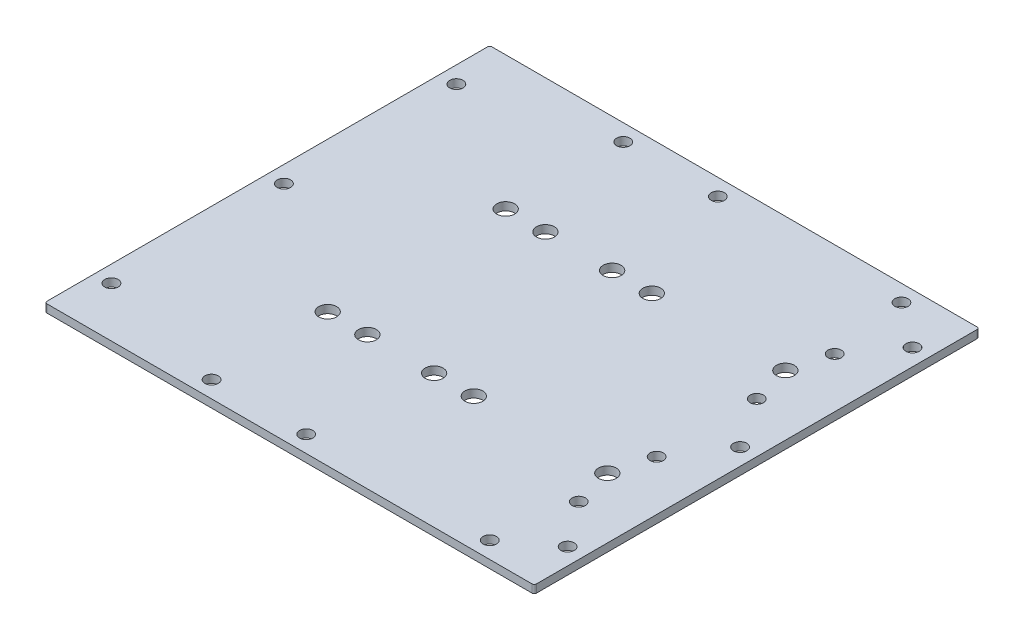
ISO-10303-21;
HEADER;
FILE_DESCRIPTION(('STEP AP214'),'2;1');
FILE_NAME('part.step','',(''),(''),'','','');
FILE_SCHEMA(('AUTOMOTIVE_DESIGN { 1 0 10303 214 1 1 1 1 }'));
ENDSEC;
DATA;
#1=APPLICATION_CONTEXT('core data for automotive mechanical design processes');
#2=APPLICATION_PROTOCOL_DEFINITION('international standard','automotive_design',2000,#1);
#3=PRODUCT_CONTEXT('',#1,'mechanical');
#4=PRODUCT('Part','Part','',(#3));
#5=PRODUCT_RELATED_PRODUCT_CATEGORY('part','',(#4));
#6=PRODUCT_DEFINITION_FORMATION('','',#4);
#7=PRODUCT_DEFINITION_CONTEXT('part definition',#1,'design');
#8=PRODUCT_DEFINITION('design','',#6,#7);
#9=PRODUCT_DEFINITION_SHAPE('','',#8);
#10=(LENGTH_UNIT() NAMED_UNIT(*) SI_UNIT(.MILLI.,.METRE.));
#11=(NAMED_UNIT(*) PLANE_ANGLE_UNIT() SI_UNIT($,.RADIAN.));
#12=(NAMED_UNIT(*) SI_UNIT($,.STERADIAN.) SOLID_ANGLE_UNIT());
#13=UNCERTAINTY_MEASURE_WITH_UNIT(LENGTH_MEASURE(1.E-05),#10,'distance_accuracy_value','');
#14=(GEOMETRIC_REPRESENTATION_CONTEXT(3) GLOBAL_UNCERTAINTY_ASSIGNED_CONTEXT((#13)) GLOBAL_UNIT_ASSIGNED_CONTEXT((#10,
#11,#12)) REPRESENTATION_CONTEXT('',''));
#15=CARTESIAN_POINT('',(0.,0.,0.));
#16=DIRECTION('',(0.,0.,1.));
#17=DIRECTION('',(1.,0.,0.));
#18=AXIS2_PLACEMENT_3D('',#15,#16,#17);
#19=CARTESIAN_POINT('',(0.,2.286,0.));
#20=DIRECTION('',(0.,-1.,0.));
#21=DIRECTION('',(0.,0.,-1.));
#22=AXIS2_PLACEMENT_3D('',#19,#20,#21);
#23=PLANE('',#22);
#24=CARTESIAN_POINT('',(55.5625,2.286,36.5125));
#25=DIRECTION('',(0.,-1.,0.));
#26=DIRECTION('',(0.,0.,-1.));
#27=AXIS2_PLACEMENT_3D('',#24,#25,#26);
#28=CIRCLE('',#27,1.89865000000001);
#29=CARTESIAN_POINT('',(55.5625,2.286,34.61385));
#30=VERTEX_POINT('',#29);
#31=EDGE_CURVE('E699',#30,#30,#28,.T.);
#32=ORIENTED_EDGE('',*,*,#31,.T.);
#33=EDGE_LOOP('',(#32));
#34=FACE_BOUND('',#33,.T.);
#35=CARTESIAN_POINT('',(55.5625,2.286,14.2875));
#36=DIRECTION('',(0.,-1.,0.));
#37=DIRECTION('',(0.,0.,-1.));
#38=AXIS2_PLACEMENT_3D('',#35,#36,#37);
#39=CIRCLE('',#38,1.89865000000001);
#40=CARTESIAN_POINT('',(55.5625,2.286,12.38885));
#41=VERTEX_POINT('',#40);
#42=EDGE_CURVE('E728',#41,#41,#39,.T.);
#43=ORIENTED_EDGE('',*,*,#42,.T.);
#44=EDGE_LOOP('',(#43));
#45=FACE_BOUND('',#44,.T.);
#46=CARTESIAN_POINT('',(55.5625,2.286,-14.2875));
#47=DIRECTION('',(0.,-1.,0.));
#48=DIRECTION('',(0.,0.,-1.));
#49=AXIS2_PLACEMENT_3D('',#46,#47,#48);
#50=CIRCLE('',#49,1.89865000000001);
#51=CARTESIAN_POINT('',(55.5625,2.286,-16.18615));
#52=VERTEX_POINT('',#51);
#53=EDGE_CURVE('E722',#52,#52,#50,.T.);
#54=ORIENTED_EDGE('',*,*,#53,.T.);
#55=EDGE_LOOP('',(#54));
#56=FACE_BOUND('',#55,.T.);
#57=CARTESIAN_POINT('',(55.5625,2.286,-36.5125));
#58=DIRECTION('',(0.,-1.,0.));
#59=DIRECTION('',(0.,0.,-1.));
#60=AXIS2_PLACEMENT_3D('',#57,#58,#59);
#61=CIRCLE('',#60,1.89865000000001);
#62=CARTESIAN_POINT('',(55.5625,2.286,-38.41115));
#63=VERTEX_POINT('',#62);
#64=EDGE_CURVE('E716',#63,#63,#61,.T.);
#65=ORIENTED_EDGE('',*,*,#64,.T.);
#66=EDGE_LOOP('',(#65));
#67=FACE_BOUND('',#66,.T.);
#68=CARTESIAN_POINT('',(-26.9875,2.286,58.7375));
#69=DIRECTION('',(0.,-1.,0.));
#70=DIRECTION('',(0.,0.,-1.));
#71=AXIS2_PLACEMENT_3D('',#68,#69,#70);
#72=CIRCLE('',#71,1.89865);
#73=CARTESIAN_POINT('',(-26.9875,2.286,56.83885));
#74=VERTEX_POINT('',#73);
#75=EDGE_CURVE('E687',#74,#74,#72,.T.);
#76=ORIENTED_EDGE('',*,*,#75,.T.);
#77=EDGE_LOOP('',(#76));
#78=FACE_BOUND('',#77,.T.);
#79=CARTESIAN_POINT('',(65.0875,2.286,49.2125));
#80=DIRECTION('',(0.,-1.,0.));
#81=DIRECTION('',(0.,0.,-1.));
#82=AXIS2_PLACEMENT_3D('',#79,#80,#81);
#83=CIRCLE('',#82,1.89865000000001);
#84=CARTESIAN_POINT('',(65.0875,2.286,47.31385));
#85=VERTEX_POINT('',#84);
#86=EDGE_CURVE('E677',#85,#85,#83,.T.);
#87=ORIENTED_EDGE('',*,*,#86,.T.);
#88=EDGE_LOOP('',(#87));
#89=FACE_BOUND('',#88,.T.);
#90=CARTESIAN_POINT('',(-65.0875,2.286,49.2125));
#91=DIRECTION('',(0.,-1.,0.));
#92=DIRECTION('',(0.,0.,-1.));
#93=AXIS2_PLACEMENT_3D('',#90,#91,#92);
#94=CIRCLE('',#93,1.89865000000001);
#95=CARTESIAN_POINT('',(-65.0875,2.286,47.31385));
#96=VERTEX_POINT('',#95);
#97=EDGE_CURVE('E676',#96,#96,#94,.T.);
#98=ORIENTED_EDGE('',*,*,#97,.T.);
#99=EDGE_LOOP('',(#98));
#100=FACE_BOUND('',#99,.T.);
#101=CARTESIAN_POINT('',(52.3875,2.286,58.7375));
#102=DIRECTION('',(0.,-1.,0.));
#103=DIRECTION('',(0.,0.,-1.));
#104=AXIS2_PLACEMENT_3D('',#101,#102,#103);
#105=CIRCLE('',#104,1.89865);
#106=CARTESIAN_POINT('',(52.3875,2.286,56.83885));
#107=VERTEX_POINT('',#106);
#108=EDGE_CURVE('E645',#107,#107,#105,.T.);
#109=ORIENTED_EDGE('',*,*,#108,.T.);
#110=EDGE_LOOP('',(#109));
#111=FACE_BOUND('',#110,.T.);
#112=CARTESIAN_POINT('',(-65.0875,2.286,0.));
#113=DIRECTION('',(0.,-1.,0.));
#114=DIRECTION('',(0.,0.,-1.));
#115=AXIS2_PLACEMENT_3D('',#112,#113,#114);
#116=CIRCLE('',#115,1.89865000000001);
#117=CARTESIAN_POINT('',(-65.0875,2.286,-1.89865000000001));
#118=VERTEX_POINT('',#117);
#119=EDGE_CURVE('E669',#118,#118,#116,.T.);
#120=ORIENTED_EDGE('',*,*,#119,.T.);
#121=EDGE_LOOP('',(#120));
#122=FACE_BOUND('',#121,.T.);
#123=CARTESIAN_POINT('',(65.0875,2.286,0.));
#124=DIRECTION('',(0.,-1.,0.));
#125=DIRECTION('',(0.,0.,-1.));
#126=AXIS2_PLACEMENT_3D('',#123,#124,#125);
#127=CIRCLE('',#126,1.89865000000001);
#128=CARTESIAN_POINT('',(65.0875,2.286,-1.89865000000001));
#129=VERTEX_POINT('',#128);
#130=EDGE_CURVE('E663',#129,#129,#127,.T.);
#131=ORIENTED_EDGE('',*,*,#130,.T.);
#132=EDGE_LOOP('',(#131));
#133=FACE_BOUND('',#132,.T.);
#134=CARTESIAN_POINT('',(-26.9875,2.286,-58.7375));
#135=DIRECTION('',(0.,-1.,0.));
#136=DIRECTION('',(0.,0.,1.));
#137=AXIS2_PLACEMENT_3D('',#134,#135,#136);
#138=CIRCLE('',#137,1.89865);
#139=CARTESIAN_POINT('',(-26.9875,2.286,-56.83885));
#140=VERTEX_POINT('',#139);
#141=EDGE_CURVE('E657',#140,#140,#138,.T.);
#142=ORIENTED_EDGE('',*,*,#141,.T.);
#143=EDGE_LOOP('',(#142));
#144=FACE_BOUND('',#143,.T.);
#145=CARTESIAN_POINT('',(52.3875,2.286,-58.7375));
#146=DIRECTION('',(0.,-1.,0.));
#147=DIRECTION('',(0.,0.,1.));
#148=AXIS2_PLACEMENT_3D('',#145,#146,#147);
#149=CIRCLE('',#148,1.89865);
#150=CARTESIAN_POINT('',(52.3875,2.286,-56.83885));
#151=VERTEX_POINT('',#150);
#152=EDGE_CURVE('E650',#151,#151,#149,.T.);
#153=ORIENTED_EDGE('',*,*,#152,.T.);
#154=EDGE_LOOP('',(#153));
#155=FACE_BOUND('',#154,.T.);
#156=CARTESIAN_POINT('',(65.0875,2.286,-49.2125));
#157=DIRECTION('',(0.,-1.,0.));
#158=DIRECTION('',(0.,0.,1.));
#159=AXIS2_PLACEMENT_3D('',#156,#157,#158);
#160=CIRCLE('',#159,1.89865000000001);
#161=CARTESIAN_POINT('',(65.0875,2.286,-47.31385));
#162=VERTEX_POINT('',#161);
#163=EDGE_CURVE('E651',#162,#162,#160,.T.);
#164=ORIENTED_EDGE('',*,*,#163,.T.);
#165=EDGE_LOOP('',(#164));
#166=FACE_BOUND('',#165,.T.);
#167=CARTESIAN_POINT('',(-65.0875,2.286,-49.2125));
#168=DIRECTION('',(0.,-1.,0.));
#169=DIRECTION('',(0.,0.,1.));
#170=AXIS2_PLACEMENT_3D('',#167,#168,#169);
#171=CIRCLE('',#170,1.89865000000001);
#172=CARTESIAN_POINT('',(-65.0875,2.286,-47.31385));
#173=VERTEX_POINT('',#172);
#174=EDGE_CURVE('E705',#173,#173,#171,.T.);
#175=ORIENTED_EDGE('',*,*,#174,.T.);
#176=EDGE_LOOP('',(#175));
#177=FACE_BOUND('',#176,.T.);
#178=CARTESIAN_POINT('',(0.,2.286,-58.7375));
#179=DIRECTION('',(0.,-1.,0.));
#180=DIRECTION('',(0.,0.,1.));
#181=AXIS2_PLACEMENT_3D('',#178,#179,#180);
#182=CIRCLE('',#181,1.89865);
#183=CARTESIAN_POINT('',(0.,2.286,-56.83885));
#184=VERTEX_POINT('',#183);
#185=EDGE_CURVE('E698',#184,#184,#182,.T.);
#186=ORIENTED_EDGE('',*,*,#185,.T.);
#187=EDGE_LOOP('',(#186));
#188=FACE_BOUND('',#187,.T.);
#189=CARTESIAN_POINT('',(0.,2.286,58.7375));
#190=DIRECTION('',(0.,-1.,0.));
#191=DIRECTION('',(0.,0.,-1.));
#192=AXIS2_PLACEMENT_3D('',#189,#190,#191);
#193=CIRCLE('',#192,1.89865);
#194=CARTESIAN_POINT('',(0.,2.286,56.83885));
#195=VERTEX_POINT('',#194);
#196=EDGE_CURVE('E639',#195,#195,#193,.T.);
#197=ORIENTED_EDGE('',*,*,#196,.T.);
#198=EDGE_LOOP('',(#197));
#199=FACE_BOUND('',#198,.T.);
#200=DIRECTION('',(0.,0.,1.));
#201=VECTOR('',#200,1.);
#202=CARTESIAN_POINT('',(-69.85,2.286,63.5));
#203=LINE('',#202,#201);
#204=CARTESIAN_POINT('',(-69.85,2.286,-62.865));
#205=VERTEX_POINT('',#204);
#206=CARTESIAN_POINT('',(-69.85,2.286,62.865));
#207=VERTEX_POINT('',#206);
#208=EDGE_CURVE('E180',#205,#207,#203,.T.);
#209=ORIENTED_EDGE('',*,*,#208,.T.);
#210=CARTESIAN_POINT('',(-69.215,2.286,62.865));
#211=DIRECTION('',(0.,-1.,0.));
#212=DIRECTION('',(0.,0.,-1.));
#213=AXIS2_PLACEMENT_3D('',#210,#211,#212);
#214=CIRCLE('',#213,0.635);
#215=CARTESIAN_POINT('',(-69.215,2.286,63.5));
#216=VERTEX_POINT('',#215);
#217=EDGE_CURVE('E157',#207,#216,#214,.F.);
#218=ORIENTED_EDGE('',*,*,#217,.T.);
#219=DIRECTION('',(1.,0.,0.));
#220=VECTOR('',#219,1.);
#221=CARTESIAN_POINT('',(-69.85,2.286,63.5));
#222=LINE('',#221,#220);
#223=CARTESIAN_POINT('',(69.215,2.286,63.5));
#224=VERTEX_POINT('',#223);
#225=EDGE_CURVE('E128',#216,#224,#222,.T.);
#226=ORIENTED_EDGE('',*,*,#225,.T.);
#227=CARTESIAN_POINT('',(69.215,2.286,62.865));
#228=DIRECTION('',(0.,-1.,0.));
#229=DIRECTION('',(0.,0.,-1.));
#230=AXIS2_PLACEMENT_3D('',#227,#228,#229);
#231=CIRCLE('',#230,0.635);
#232=CARTESIAN_POINT('',(69.85,2.286,62.865));
#233=VERTEX_POINT('',#232);
#234=EDGE_CURVE('E155',#224,#233,#231,.F.);
#235=ORIENTED_EDGE('',*,*,#234,.T.);
#236=DIRECTION('',(0.,0.,-1.));
#237=VECTOR('',#236,1.);
#238=CARTESIAN_POINT('',(69.85,2.286,63.5));
#239=LINE('',#238,#237);
#240=CARTESIAN_POINT('',(69.85,2.286,-62.865));
#241=VERTEX_POINT('',#240);
#242=EDGE_CURVE('E135',#233,#241,#239,.T.);
#243=ORIENTED_EDGE('',*,*,#242,.T.);
#244=CARTESIAN_POINT('',(69.215,2.286,-62.865));
#245=DIRECTION('',(0.,-1.,0.));
#246=DIRECTION('',(0.,0.,-1.));
#247=AXIS2_PLACEMENT_3D('',#244,#245,#246);
#248=CIRCLE('',#247,0.635);
#249=CARTESIAN_POINT('',(69.215,2.286,-63.5));
#250=VERTEX_POINT('',#249);
#251=EDGE_CURVE('E63',#241,#250,#248,.F.);
#252=ORIENTED_EDGE('',*,*,#251,.T.);
#253=DIRECTION('',(-1.,0.,0.));
#254=VECTOR('',#253,1.);
#255=CARTESIAN_POINT('',(-69.85,2.286,-63.5));
#256=LINE('',#255,#254);
#257=CARTESIAN_POINT('',(-69.215,2.286,-63.5));
#258=VERTEX_POINT('',#257);
#259=EDGE_CURVE('E139',#250,#258,#256,.T.);
#260=ORIENTED_EDGE('',*,*,#259,.T.);
#261=CARTESIAN_POINT('',(-69.215,2.286,-62.865));
#262=DIRECTION('',(0.,-1.,0.));
#263=DIRECTION('',(0.,0.,-1.));
#264=AXIS2_PLACEMENT_3D('',#261,#262,#263);
#265=CIRCLE('',#264,0.635);
#266=EDGE_CURVE('E153',#258,#205,#265,.F.);
#267=ORIENTED_EDGE('',*,*,#266,.T.);
#268=EDGE_LOOP('',(#209,#218,#226,#235,#243,#252,#260,#267));
#269=FACE_BOUND('',#268,.T.);
#270=CARTESIAN_POINT('',(-15.875,2.286,-25.4));
#271=DIRECTION('',(0.,1.,0.));
#272=DIRECTION('',(0.,0.,1.));
#273=AXIS2_PLACEMENT_3D('',#270,#271,#272);
#274=CIRCLE('',#273,2.5527);
#275=CARTESIAN_POINT('',(-15.875,2.286,-22.8473));
#276=VERTEX_POINT('',#275);
#277=EDGE_CURVE('E172',#276,#276,#274,.T.);
#278=ORIENTED_EDGE('',*,*,#277,.F.);
#279=EDGE_LOOP('',(#278));
#280=FACE_BOUND('',#279,.T.);
#281=CARTESIAN_POINT('',(3.175,2.286,-25.4));
#282=DIRECTION('',(0.,1.,0.));
#283=DIRECTION('',(0.,0.,1.));
#284=AXIS2_PLACEMENT_3D('',#281,#282,#283);
#285=CIRCLE('',#284,2.5527);
#286=CARTESIAN_POINT('',(3.175,2.286,-22.8473));
#287=VERTEX_POINT('',#286);
#288=EDGE_CURVE('E606',#287,#287,#285,.T.);
#289=ORIENTED_EDGE('',*,*,#288,.F.);
#290=EDGE_LOOP('',(#289));
#291=FACE_BOUND('',#290,.T.);
#292=CARTESIAN_POINT('',(-15.875,2.286,25.4));
#293=DIRECTION('',(0.,1.,0.));
#294=DIRECTION('',(0.,0.,1.));
#295=AXIS2_PLACEMENT_3D('',#292,#293,#294);
#296=CIRCLE('',#295,2.5527);
#297=CARTESIAN_POINT('',(-15.875,2.286,27.9527));
#298=VERTEX_POINT('',#297);
#299=EDGE_CURVE('E600',#298,#298,#296,.T.);
#300=ORIENTED_EDGE('',*,*,#299,.F.);
#301=EDGE_LOOP('',(#300));
#302=FACE_BOUND('',#301,.T.);
#303=CARTESIAN_POINT('',(3.175,2.286,25.4));
#304=DIRECTION('',(0.,1.,0.));
#305=DIRECTION('',(0.,0.,1.));
#306=AXIS2_PLACEMENT_3D('',#303,#304,#305);
#307=CIRCLE('',#306,2.5527);
#308=CARTESIAN_POINT('',(3.175,2.286,27.9527));
#309=VERTEX_POINT('',#308);
#310=EDGE_CURVE('E594',#309,#309,#307,.T.);
#311=ORIENTED_EDGE('',*,*,#310,.F.);
#312=EDGE_LOOP('',(#311));
#313=FACE_BOUND('',#312,.T.);
#314=CARTESIAN_POINT('',(-27.2034,2.286,-25.4));
#315=DIRECTION('',(0.,1.,0.));
#316=DIRECTION('',(0.,0.,1.));
#317=AXIS2_PLACEMENT_3D('',#314,#315,#316);
#318=CIRCLE('',#317,2.5527);
#319=CARTESIAN_POINT('',(-27.2034,2.286,-22.8473));
#320=VERTEX_POINT('',#319);
#321=EDGE_CURVE('E588',#320,#320,#318,.T.);
#322=ORIENTED_EDGE('',*,*,#321,.F.);
#323=EDGE_LOOP('',(#322));
#324=FACE_BOUND('',#323,.T.);
#325=CARTESIAN_POINT('',(14.5034,2.286,-25.4));
#326=DIRECTION('',(0.,1.,0.));
#327=DIRECTION('',(0.,0.,1.));
#328=AXIS2_PLACEMENT_3D('',#325,#326,#327);
#329=CIRCLE('',#328,2.5527);
#330=CARTESIAN_POINT('',(14.5034,2.286,-22.8473));
#331=VERTEX_POINT('',#330);
#332=EDGE_CURVE('E582',#331,#331,#329,.T.);
#333=ORIENTED_EDGE('',*,*,#332,.F.);
#334=EDGE_LOOP('',(#333));
#335=FACE_BOUND('',#334,.T.);
#336=CARTESIAN_POINT('',(14.5034,2.286,25.4));
#337=DIRECTION('',(0.,1.,0.));
#338=DIRECTION('',(0.,0.,1.));
#339=AXIS2_PLACEMENT_3D('',#336,#337,#338);
#340=CIRCLE('',#339,2.5527);
#341=CARTESIAN_POINT('',(14.5034,2.286,27.9527));
#342=VERTEX_POINT('',#341);
#343=EDGE_CURVE('E576',#342,#342,#340,.T.);
#344=ORIENTED_EDGE('',*,*,#343,.F.);
#345=EDGE_LOOP('',(#344));
#346=FACE_BOUND('',#345,.T.);
#347=CARTESIAN_POINT('',(-27.2034,2.286,25.4));
#348=DIRECTION('',(0.,1.,0.));
#349=DIRECTION('',(0.,0.,1.));
#350=AXIS2_PLACEMENT_3D('',#347,#348,#349);
#351=CIRCLE('',#350,2.5527);
#352=CARTESIAN_POINT('',(-27.2034,2.286,27.9527));
#353=VERTEX_POINT('',#352);
#354=EDGE_CURVE('E570',#353,#353,#351,.T.);
#355=ORIENTED_EDGE('',*,*,#354,.F.);
#356=EDGE_LOOP('',(#355));
#357=FACE_BOUND('',#356,.T.);
#358=CARTESIAN_POINT('',(52.6034,2.286,-25.4));
#359=DIRECTION('',(0.,1.,0.));
#360=DIRECTION('',(0.,0.,1.));
#361=AXIS2_PLACEMENT_3D('',#358,#359,#360);
#362=CIRCLE('',#361,2.5527);
#363=CARTESIAN_POINT('',(52.6034,2.286,-22.8473));
#364=VERTEX_POINT('',#363);
#365=EDGE_CURVE('E556',#364,#364,#362,.T.);
#366=ORIENTED_EDGE('',*,*,#365,.F.);
#367=EDGE_LOOP('',(#366));
#368=FACE_BOUND('',#367,.T.);
#369=CARTESIAN_POINT('',(52.6034,2.286,25.4));
#370=DIRECTION('',(0.,1.,0.));
#371=DIRECTION('',(0.,0.,1.));
#372=AXIS2_PLACEMENT_3D('',#369,#370,#371);
#373=CIRCLE('',#372,2.5527);
#374=CARTESIAN_POINT('',(52.6034,2.286,27.9527));
#375=VERTEX_POINT('',#374);
#376=EDGE_CURVE('E561',#375,#375,#373,.T.);
#377=ORIENTED_EDGE('',*,*,#376,.F.);
#378=EDGE_LOOP('',(#377));
#379=FACE_BOUND('',#378,.T.);
#380=ADVANCED_FACE('F43',(#34,#45,#56,#67,#78,#89,#100,#111,#122,#133,#144,#155,#166,#177,#188,
#199,#269,#280,#291,#302,#313,#324,#335,#346,#357,#368,#379),#23,.F.);
#381=CARTESIAN_POINT('',(0.,0.,0.));
#382=DIRECTION('',(0.,-1.,0.));
#383=DIRECTION('',(0.,0.,-1.));
#384=AXIS2_PLACEMENT_3D('',#381,#382,#383);
#385=PLANE('',#384);
#386=CARTESIAN_POINT('',(55.5625,0.,36.5125));
#387=DIRECTION('',(0.,-1.,0.));
#388=DIRECTION('',(0.,0.,-1.));
#389=AXIS2_PLACEMENT_3D('',#386,#387,#388);
#390=CIRCLE('',#389,1.89865000000001);
#391=CARTESIAN_POINT('',(55.5625,0.,34.61385));
#392=VERTEX_POINT('',#391);
#393=EDGE_CURVE('E731',#392,#392,#390,.T.);
#394=ORIENTED_EDGE('',*,*,#393,.F.);
#395=EDGE_LOOP('',(#394));
#396=FACE_BOUND('',#395,.T.);
#397=CARTESIAN_POINT('',(55.5625,0.,14.2875));
#398=DIRECTION('',(0.,-1.,0.));
#399=DIRECTION('',(0.,0.,-1.));
#400=AXIS2_PLACEMENT_3D('',#397,#398,#399);
#401=CIRCLE('',#400,1.89865000000001);
#402=CARTESIAN_POINT('',(55.5625,0.,12.38885));
#403=VERTEX_POINT('',#402);
#404=EDGE_CURVE('E725',#403,#403,#401,.T.);
#405=ORIENTED_EDGE('',*,*,#404,.F.);
#406=EDGE_LOOP('',(#405));
#407=FACE_BOUND('',#406,.T.);
#408=CARTESIAN_POINT('',(55.5625,0.,-14.2875));
#409=DIRECTION('',(0.,-1.,0.));
#410=DIRECTION('',(0.,0.,-1.));
#411=AXIS2_PLACEMENT_3D('',#408,#409,#410);
#412=CIRCLE('',#411,1.89865000000001);
#413=CARTESIAN_POINT('',(55.5625,0.,-16.18615));
#414=VERTEX_POINT('',#413);
#415=EDGE_CURVE('E719',#414,#414,#412,.T.);
#416=ORIENTED_EDGE('',*,*,#415,.F.);
#417=EDGE_LOOP('',(#416));
#418=FACE_BOUND('',#417,.T.);
#419=CARTESIAN_POINT('',(55.5625,0.,-36.5125));
#420=DIRECTION('',(0.,-1.,0.));
#421=DIRECTION('',(0.,0.,-1.));
#422=AXIS2_PLACEMENT_3D('',#419,#420,#421);
#423=CIRCLE('',#422,1.89865000000001);
#424=CARTESIAN_POINT('',(55.5625,0.,-38.41115));
#425=VERTEX_POINT('',#424);
#426=EDGE_CURVE('E713',#425,#425,#423,.T.);
#427=ORIENTED_EDGE('',*,*,#426,.F.);
#428=EDGE_LOOP('',(#427));
#429=FACE_BOUND('',#428,.T.);
#430=CARTESIAN_POINT('',(-26.9875,0.,58.7375));
#431=DIRECTION('',(0.,-1.,0.));
#432=DIRECTION('',(0.,0.,-1.));
#433=AXIS2_PLACEMENT_3D('',#430,#431,#432);
#434=CIRCLE('',#433,1.89865);
#435=CARTESIAN_POINT('',(-26.9875,0.,56.83885));
#436=VERTEX_POINT('',#435);
#437=EDGE_CURVE('E672',#436,#436,#434,.T.);
#438=ORIENTED_EDGE('',*,*,#437,.F.);
#439=EDGE_LOOP('',(#438));
#440=FACE_BOUND('',#439,.T.);
#441=CARTESIAN_POINT('',(65.0875,0.,49.2125));
#442=DIRECTION('',(0.,-1.,0.));
#443=DIRECTION('',(0.,0.,-1.));
#444=AXIS2_PLACEMENT_3D('',#441,#442,#443);
#445=CIRCLE('',#444,1.89865000000001);
#446=CARTESIAN_POINT('',(65.0875,0.,47.31385));
#447=VERTEX_POINT('',#446);
#448=EDGE_CURVE('E690',#447,#447,#445,.T.);
#449=ORIENTED_EDGE('',*,*,#448,.F.);
#450=EDGE_LOOP('',(#449));
#451=FACE_BOUND('',#450,.T.);
#452=CARTESIAN_POINT('',(-65.0875,0.,49.2125));
#453=DIRECTION('',(0.,-1.,0.));
#454=DIRECTION('',(0.,0.,-1.));
#455=AXIS2_PLACEMENT_3D('',#452,#453,#454);
#456=CIRCLE('',#455,1.89865000000001);
#457=CARTESIAN_POINT('',(-65.0875,0.,47.31385));
#458=VERTEX_POINT('',#457);
#459=EDGE_CURVE('E673',#458,#458,#456,.T.);
#460=ORIENTED_EDGE('',*,*,#459,.F.);
#461=EDGE_LOOP('',(#460));
#462=FACE_BOUND('',#461,.T.);
#463=CARTESIAN_POINT('',(52.3875,0.,58.7375));
#464=DIRECTION('',(0.,-1.,0.));
#465=DIRECTION('',(0.,0.,-1.));
#466=AXIS2_PLACEMENT_3D('',#463,#464,#465);
#467=CIRCLE('',#466,1.89865);
#468=CARTESIAN_POINT('',(52.3875,0.,56.83885));
#469=VERTEX_POINT('',#468);
#470=EDGE_CURVE('E680',#469,#469,#467,.T.);
#471=ORIENTED_EDGE('',*,*,#470,.F.);
#472=EDGE_LOOP('',(#471));
#473=FACE_BOUND('',#472,.T.);
#474=CARTESIAN_POINT('',(-65.0875,0.,0.));
#475=DIRECTION('',(0.,-1.,0.));
#476=DIRECTION('',(0.,0.,-1.));
#477=AXIS2_PLACEMENT_3D('',#474,#475,#476);
#478=CIRCLE('',#477,1.89865000000001);
#479=CARTESIAN_POINT('',(-65.0875,0.,-1.89865000000001));
#480=VERTEX_POINT('',#479);
#481=EDGE_CURVE('E666',#480,#480,#478,.T.);
#482=ORIENTED_EDGE('',*,*,#481,.F.);
#483=EDGE_LOOP('',(#482));
#484=FACE_BOUND('',#483,.T.);
#485=CARTESIAN_POINT('',(65.0875,0.,0.));
#486=DIRECTION('',(0.,-1.,0.));
#487=DIRECTION('',(0.,0.,-1.));
#488=AXIS2_PLACEMENT_3D('',#485,#486,#487);
#489=CIRCLE('',#488,1.89865000000001);
#490=CARTESIAN_POINT('',(65.0875,0.,-1.89865000000001));
#491=VERTEX_POINT('',#490);
#492=EDGE_CURVE('E660',#491,#491,#489,.T.);
#493=ORIENTED_EDGE('',*,*,#492,.F.);
#494=EDGE_LOOP('',(#493));
#495=FACE_BOUND('',#494,.T.);
#496=CARTESIAN_POINT('',(-26.9875,0.,-58.7375));
#497=DIRECTION('',(0.,-1.,0.));
#498=DIRECTION('',(0.,0.,1.));
#499=AXIS2_PLACEMENT_3D('',#496,#497,#498);
#500=CIRCLE('',#499,1.89865);
#501=CARTESIAN_POINT('',(-26.9875,0.,-56.83885));
#502=VERTEX_POINT('',#501);
#503=EDGE_CURVE('E654',#502,#502,#500,.T.);
#504=ORIENTED_EDGE('',*,*,#503,.F.);
#505=EDGE_LOOP('',(#504));
#506=FACE_BOUND('',#505,.T.);
#507=CARTESIAN_POINT('',(52.3875,0.,-58.7375));
#508=DIRECTION('',(0.,-1.,0.));
#509=DIRECTION('',(0.,0.,1.));
#510=AXIS2_PLACEMENT_3D('',#507,#508,#509);
#511=CIRCLE('',#510,1.89865);
#512=CARTESIAN_POINT('',(52.3875,0.,-56.83885));
#513=VERTEX_POINT('',#512);
#514=EDGE_CURVE('E647',#513,#513,#511,.T.);
#515=ORIENTED_EDGE('',*,*,#514,.F.);
#516=EDGE_LOOP('',(#515));
#517=FACE_BOUND('',#516,.T.);
#518=CARTESIAN_POINT('',(65.0875,0.,-49.2125));
#519=DIRECTION('',(0.,-1.,0.));
#520=DIRECTION('',(0.,0.,1.));
#521=AXIS2_PLACEMENT_3D('',#518,#519,#520);
#522=CIRCLE('',#521,1.89865000000001);
#523=CARTESIAN_POINT('',(65.0875,0.,-47.31385));
#524=VERTEX_POINT('',#523);
#525=EDGE_CURVE('E708',#524,#524,#522,.T.);
#526=ORIENTED_EDGE('',*,*,#525,.F.);
#527=EDGE_LOOP('',(#526));
#528=FACE_BOUND('',#527,.T.);
#529=CARTESIAN_POINT('',(-65.0875,0.,-49.2125));
#530=DIRECTION('',(0.,-1.,0.));
#531=DIRECTION('',(0.,0.,1.));
#532=AXIS2_PLACEMENT_3D('',#529,#530,#531);
#533=CIRCLE('',#532,1.89865000000001);
#534=CARTESIAN_POINT('',(-65.0875,0.,-47.31385));
#535=VERTEX_POINT('',#534);
#536=EDGE_CURVE('E702',#535,#535,#533,.T.);
#537=ORIENTED_EDGE('',*,*,#536,.F.);
#538=EDGE_LOOP('',(#537));
#539=FACE_BOUND('',#538,.T.);
#540=CARTESIAN_POINT('',(0.,0.,-58.7375));
#541=DIRECTION('',(0.,-1.,0.));
#542=DIRECTION('',(0.,0.,1.));
#543=AXIS2_PLACEMENT_3D('',#540,#541,#542);
#544=CIRCLE('',#543,1.89865);
#545=CARTESIAN_POINT('',(0.,0.,-56.83885));
#546=VERTEX_POINT('',#545);
#547=EDGE_CURVE('E695',#546,#546,#544,.T.);
#548=ORIENTED_EDGE('',*,*,#547,.F.);
#549=EDGE_LOOP('',(#548));
#550=FACE_BOUND('',#549,.T.);
#551=CARTESIAN_POINT('',(0.,0.,58.7375));
#552=DIRECTION('',(0.,-1.,0.));
#553=DIRECTION('',(0.,0.,-1.));
#554=AXIS2_PLACEMENT_3D('',#551,#552,#553);
#555=CIRCLE('',#554,1.89865);
#556=CARTESIAN_POINT('',(0.,0.,56.83885));
#557=VERTEX_POINT('',#556);
#558=EDGE_CURVE('E641',#557,#557,#555,.T.);
#559=ORIENTED_EDGE('',*,*,#558,.F.);
#560=EDGE_LOOP('',(#559));
#561=FACE_BOUND('',#560,.T.);
#562=CARTESIAN_POINT('',(52.6034,0.,-25.4));
#563=DIRECTION('',(0.,1.,0.));
#564=DIRECTION('',(0.,0.,1.));
#565=AXIS2_PLACEMENT_3D('',#562,#563,#564);
#566=CIRCLE('',#565,2.5527);
#567=CARTESIAN_POINT('',(52.6034,0.,-22.8473));
#568=VERTEX_POINT('',#567);
#569=EDGE_CURVE('E559',#568,#568,#566,.T.);
#570=ORIENTED_EDGE('',*,*,#569,.T.);
#571=EDGE_LOOP('',(#570));
#572=FACE_BOUND('',#571,.T.);
#573=CARTESIAN_POINT('',(14.5034,0.,25.4));
#574=DIRECTION('',(0.,1.,0.));
#575=DIRECTION('',(0.,0.,1.));
#576=AXIS2_PLACEMENT_3D('',#573,#574,#575);
#577=CIRCLE('',#576,2.5527);
#578=CARTESIAN_POINT('',(14.5034,0.,27.9527));
#579=VERTEX_POINT('',#578);
#580=EDGE_CURVE('E573',#579,#579,#577,.T.);
#581=ORIENTED_EDGE('',*,*,#580,.T.);
#582=EDGE_LOOP('',(#581));
#583=FACE_BOUND('',#582,.T.);
#584=CARTESIAN_POINT('',(-27.2034,0.,-25.4));
#585=DIRECTION('',(0.,1.,0.));
#586=DIRECTION('',(0.,0.,1.));
#587=AXIS2_PLACEMENT_3D('',#584,#585,#586);
#588=CIRCLE('',#587,2.5527);
#589=CARTESIAN_POINT('',(-27.2034,0.,-22.8473));
#590=VERTEX_POINT('',#589);
#591=EDGE_CURVE('E585',#590,#590,#588,.T.);
#592=ORIENTED_EDGE('',*,*,#591,.T.);
#593=EDGE_LOOP('',(#592));
#594=FACE_BOUND('',#593,.T.);
#595=CARTESIAN_POINT('',(-15.875,0.,25.4));
#596=DIRECTION('',(0.,1.,0.));
#597=DIRECTION('',(0.,0.,1.));
#598=AXIS2_PLACEMENT_3D('',#595,#596,#597);
#599=CIRCLE('',#598,2.5527);
#600=CARTESIAN_POINT('',(-15.875,0.,27.9527));
#601=VERTEX_POINT('',#600);
#602=EDGE_CURVE('E597',#601,#601,#599,.T.);
#603=ORIENTED_EDGE('',*,*,#602,.T.);
#604=EDGE_LOOP('',(#603));
#605=FACE_BOUND('',#604,.T.);
#606=CARTESIAN_POINT('',(-15.875,0.,-25.4));
#607=DIRECTION('',(0.,1.,0.));
#608=DIRECTION('',(0.,0.,1.));
#609=AXIS2_PLACEMENT_3D('',#606,#607,#608);
#610=CIRCLE('',#609,2.5527);
#611=CARTESIAN_POINT('',(-15.875,0.,-22.8473));
#612=VERTEX_POINT('',#611);
#613=EDGE_CURVE('E609',#612,#612,#610,.T.);
#614=ORIENTED_EDGE('',*,*,#613,.T.);
#615=EDGE_LOOP('',(#614));
#616=FACE_BOUND('',#615,.T.);
#617=DIRECTION('',(1.,0.,0.));
#618=VECTOR('',#617,1.);
#619=CARTESIAN_POINT('',(-69.85,0.,63.5));
#620=LINE('',#619,#618);
#621=CARTESIAN_POINT('',(-69.215,0.,63.5));
#622=VERTEX_POINT('',#621);
#623=CARTESIAN_POINT('',(69.215,0.,63.5));
#624=VERTEX_POINT('',#623);
#625=EDGE_CURVE('E125',#622,#624,#620,.T.);
#626=ORIENTED_EDGE('',*,*,#625,.F.);
#627=CARTESIAN_POINT('',(-69.215,0.,62.865));
#628=DIRECTION('',(0.,-1.,0.));
#629=DIRECTION('',(0.,0.,-1.));
#630=AXIS2_PLACEMENT_3D('',#627,#628,#629);
#631=CIRCLE('',#630,0.635);
#632=CARTESIAN_POINT('',(-69.85,0.,62.865));
#633=VERTEX_POINT('',#632);
#634=EDGE_CURVE('E108',#622,#633,#631,.T.);
#635=ORIENTED_EDGE('',*,*,#634,.T.);
#636=DIRECTION('',(0.,0.,1.));
#637=VECTOR('',#636,1.);
#638=CARTESIAN_POINT('',(-69.85,0.,63.5));
#639=LINE('',#638,#637);
#640=CARTESIAN_POINT('',(-69.85,0.,-62.865));
#641=VERTEX_POINT('',#640);
#642=EDGE_CURVE('E136',#641,#633,#639,.T.);
#643=ORIENTED_EDGE('',*,*,#642,.F.);
#644=CARTESIAN_POINT('',(-69.215,0.,-62.865));
#645=DIRECTION('',(0.,-1.,0.));
#646=DIRECTION('',(0.,0.,-1.));
#647=AXIS2_PLACEMENT_3D('',#644,#645,#646);
#648=CIRCLE('',#647,0.635);
#649=CARTESIAN_POINT('',(-69.215,0.,-63.5));
#650=VERTEX_POINT('',#649);
#651=EDGE_CURVE('E146',#641,#650,#648,.T.);
#652=ORIENTED_EDGE('',*,*,#651,.T.);
#653=DIRECTION('',(-1.,0.,0.));
#654=VECTOR('',#653,1.);
#655=CARTESIAN_POINT('',(-69.85,0.,-63.5));
#656=LINE('',#655,#654);
#657=CARTESIAN_POINT('',(69.215,0.,-63.5));
#658=VERTEX_POINT('',#657);
#659=EDGE_CURVE('E140',#658,#650,#656,.T.);
#660=ORIENTED_EDGE('',*,*,#659,.F.);
#661=CARTESIAN_POINT('',(69.215,0.,-62.865));
#662=DIRECTION('',(0.,-1.,0.));
#663=DIRECTION('',(0.,0.,-1.));
#664=AXIS2_PLACEMENT_3D('',#661,#662,#663);
#665=CIRCLE('',#664,0.635);
#666=CARTESIAN_POINT('',(69.85,0.,-62.865));
#667=VERTEX_POINT('',#666);
#668=EDGE_CURVE('E129',#658,#667,#665,.T.);
#669=ORIENTED_EDGE('',*,*,#668,.T.);
#670=DIRECTION('',(0.,0.,-1.));
#671=VECTOR('',#670,1.);
#672=CARTESIAN_POINT('',(69.85,0.,63.5));
#673=LINE('',#672,#671);
#674=CARTESIAN_POINT('',(69.85,0.,62.865));
#675=VERTEX_POINT('',#674);
#676=EDGE_CURVE('E170',#675,#667,#673,.T.);
#677=ORIENTED_EDGE('',*,*,#676,.F.);
#678=CARTESIAN_POINT('',(69.215,0.,62.865));
#679=DIRECTION('',(0.,-1.,0.));
#680=DIRECTION('',(0.,0.,-1.));
#681=AXIS2_PLACEMENT_3D('',#678,#679,#680);
#682=CIRCLE('',#681,0.635);
#683=EDGE_CURVE('E119',#675,#624,#682,.T.);
#684=ORIENTED_EDGE('',*,*,#683,.T.);
#685=EDGE_LOOP('',(#626,#635,#643,#652,#660,#669,#677,#684));
#686=FACE_BOUND('',#685,.T.);
#687=CARTESIAN_POINT('',(3.175,0.,-25.4));
#688=DIRECTION('',(0.,1.,0.));
#689=DIRECTION('',(0.,0.,1.));
#690=AXIS2_PLACEMENT_3D('',#687,#688,#689);
#691=CIRCLE('',#690,2.5527);
#692=CARTESIAN_POINT('',(3.175,0.,-22.8473));
#693=VERTEX_POINT('',#692);
#694=EDGE_CURVE('E603',#693,#693,#691,.T.);
#695=ORIENTED_EDGE('',*,*,#694,.T.);
#696=EDGE_LOOP('',(#695));
#697=FACE_BOUND('',#696,.T.);
#698=CARTESIAN_POINT('',(3.175,0.,25.4));
#699=DIRECTION('',(0.,1.,0.));
#700=DIRECTION('',(0.,0.,1.));
#701=AXIS2_PLACEMENT_3D('',#698,#699,#700);
#702=CIRCLE('',#701,2.5527);
#703=CARTESIAN_POINT('',(3.175,0.,27.9527));
#704=VERTEX_POINT('',#703);
#705=EDGE_CURVE('E591',#704,#704,#702,.T.);
#706=ORIENTED_EDGE('',*,*,#705,.T.);
#707=EDGE_LOOP('',(#706));
#708=FACE_BOUND('',#707,.T.);
#709=CARTESIAN_POINT('',(14.5034,0.,-25.4));
#710=DIRECTION('',(0.,1.,0.));
#711=DIRECTION('',(0.,0.,1.));
#712=AXIS2_PLACEMENT_3D('',#709,#710,#711);
#713=CIRCLE('',#712,2.5527);
#714=CARTESIAN_POINT('',(14.5034,0.,-22.8473));
#715=VERTEX_POINT('',#714);
#716=EDGE_CURVE('E579',#715,#715,#713,.T.);
#717=ORIENTED_EDGE('',*,*,#716,.T.);
#718=EDGE_LOOP('',(#717));
#719=FACE_BOUND('',#718,.T.);
#720=CARTESIAN_POINT('',(-27.2034,0.,25.4));
#721=DIRECTION('',(0.,1.,0.));
#722=DIRECTION('',(0.,0.,1.));
#723=AXIS2_PLACEMENT_3D('',#720,#721,#722);
#724=CIRCLE('',#723,2.5527);
#725=CARTESIAN_POINT('',(-27.2034,0.,27.9527));
#726=VERTEX_POINT('',#725);
#727=EDGE_CURVE('E563',#726,#726,#724,.T.);
#728=ORIENTED_EDGE('',*,*,#727,.T.);
#729=EDGE_LOOP('',(#728));
#730=FACE_BOUND('',#729,.T.);
#731=CARTESIAN_POINT('',(52.6034,0.,25.4));
#732=DIRECTION('',(0.,1.,0.));
#733=DIRECTION('',(0.,0.,1.));
#734=AXIS2_PLACEMENT_3D('',#731,#732,#733);
#735=CIRCLE('',#734,2.5527);
#736=CARTESIAN_POINT('',(52.6034,0.,27.9527));
#737=VERTEX_POINT('',#736);
#738=EDGE_CURVE('E566',#737,#737,#735,.T.);
#739=ORIENTED_EDGE('',*,*,#738,.T.);
#740=EDGE_LOOP('',(#739));
#741=FACE_BOUND('',#740,.T.);
#742=ADVANCED_FACE('F132',(#396,#407,#418,#429,#440,#451,#462,#473,#484,#495,#506,#517,#528,
#539,#550,#561,#572,#583,#594,#605,#616,#686,#697,#708,#719,#730,#741),#385,.T.);
#743=CARTESIAN_POINT('',(69.85,2.286,63.5));
#744=DIRECTION('',(-1.,0.,0.));
#745=DIRECTION('',(0.,0.,1.));
#746=AXIS2_PLACEMENT_3D('',#743,#744,#745);
#747=PLANE('',#746);
#748=ORIENTED_EDGE('',*,*,#242,.F.);
#749=DIRECTION('',(0.,-1.,0.));
#750=VECTOR('',#749,1.);
#751=CARTESIAN_POINT('',(69.85,2.286,62.865));
#752=LINE('',#751,#750);
#753=EDGE_CURVE('E161',#233,#675,#752,.T.);
#754=ORIENTED_EDGE('',*,*,#753,.T.);
#755=ORIENTED_EDGE('',*,*,#676,.T.);
#756=DIRECTION('',(0.,-1.,0.));
#757=VECTOR('',#756,1.);
#758=CARTESIAN_POINT('',(69.85,2.286,-62.865));
#759=LINE('',#758,#757);
#760=EDGE_CURVE('E159',#667,#241,#759,.F.);
#761=ORIENTED_EDGE('',*,*,#760,.T.);
#762=EDGE_LOOP('',(#748,#754,#755,#761));
#763=FACE_BOUND('',#762,.T.);
#764=ADVANCED_FACE('F191',(#763),#747,.F.);
#765=CARTESIAN_POINT('',(-69.85,2.286,-63.5));
#766=DIRECTION('',(0.,0.,1.));
#767=DIRECTION('',(1.,0.,0.));
#768=AXIS2_PLACEMENT_3D('',#765,#766,#767);
#769=PLANE('',#768);
#770=ORIENTED_EDGE('',*,*,#659,.T.);
#771=DIRECTION('',(0.,-1.,0.));
#772=VECTOR('',#771,1.);
#773=CARTESIAN_POINT('',(-69.215,2.286,-63.5));
#774=LINE('',#773,#772);
#775=EDGE_CURVE('E12',#650,#258,#774,.F.);
#776=ORIENTED_EDGE('',*,*,#775,.T.);
#777=ORIENTED_EDGE('',*,*,#259,.F.);
#778=DIRECTION('',(0.,-1.,0.));
#779=VECTOR('',#778,1.);
#780=CARTESIAN_POINT('',(69.215,2.286,-63.5));
#781=LINE('',#780,#779);
#782=EDGE_CURVE('E51',#250,#658,#781,.T.);
#783=ORIENTED_EDGE('',*,*,#782,.T.);
#784=EDGE_LOOP('',(#770,#776,#777,#783));
#785=FACE_BOUND('',#784,.T.);
#786=ADVANCED_FACE('F166',(#785),#769,.F.);
#787=CARTESIAN_POINT('',(-69.85,2.286,63.5));
#788=DIRECTION('',(1.,0.,0.));
#789=DIRECTION('',(0.,0.,-1.));
#790=AXIS2_PLACEMENT_3D('',#787,#788,#789);
#791=PLANE('',#790);
#792=ORIENTED_EDGE('',*,*,#642,.T.);
#793=DIRECTION('',(0.,-1.,0.));
#794=VECTOR('',#793,1.);
#795=CARTESIAN_POINT('',(-69.85,2.286,62.865));
#796=LINE('',#795,#794);
#797=EDGE_CURVE('E113',#633,#207,#796,.F.);
#798=ORIENTED_EDGE('',*,*,#797,.T.);
#799=ORIENTED_EDGE('',*,*,#208,.F.);
#800=DIRECTION('',(0.,-1.,0.));
#801=VECTOR('',#800,1.);
#802=CARTESIAN_POINT('',(-69.85,2.286,-62.865));
#803=LINE('',#802,#801);
#804=EDGE_CURVE('E118',#205,#641,#803,.T.);
#805=ORIENTED_EDGE('',*,*,#804,.T.);
#806=EDGE_LOOP('',(#792,#798,#799,#805));
#807=FACE_BOUND('',#806,.T.);
#808=ADVANCED_FACE('F220',(#807),#791,.F.);
#809=CARTESIAN_POINT('',(-69.85,2.286,63.5));
#810=DIRECTION('',(0.,0.,-1.));
#811=DIRECTION('',(-1.,0.,0.));
#812=AXIS2_PLACEMENT_3D('',#809,#810,#811);
#813=PLANE('',#812);
#814=ORIENTED_EDGE('',*,*,#225,.F.);
#815=DIRECTION('',(0.,-1.,0.));
#816=VECTOR('',#815,1.);
#817=CARTESIAN_POINT('',(-69.215,2.286,63.5));
#818=LINE('',#817,#816);
#819=EDGE_CURVE('E112',#216,#622,#818,.T.);
#820=ORIENTED_EDGE('',*,*,#819,.T.);
#821=ORIENTED_EDGE('',*,*,#625,.T.);
#822=DIRECTION('',(0.,-1.,0.));
#823=VECTOR('',#822,1.);
#824=CARTESIAN_POINT('',(69.215,2.286,63.5));
#825=LINE('',#824,#823);
#826=EDGE_CURVE('E130',#624,#224,#825,.F.);
#827=ORIENTED_EDGE('',*,*,#826,.T.);
#828=EDGE_LOOP('',(#814,#820,#821,#827));
#829=FACE_BOUND('',#828,.T.);
#830=ADVANCED_FACE('F124',(#829),#813,.F.);
#831=CARTESIAN_POINT('',(-15.875,2.286,-25.4));
#832=DIRECTION('',(0.,-1.,0.));
#833=DIRECTION('',(0.,0.,-1.));
#834=AXIS2_PLACEMENT_3D('',#831,#832,#833);
#835=CYLINDRICAL_SURFACE('',#834,2.5527);
#836=ORIENTED_EDGE('',*,*,#277,.T.);
#837=EDGE_LOOP('',(#836));
#838=FACE_BOUND('',#837,.T.);
#839=ORIENTED_EDGE('',*,*,#613,.F.);
#840=EDGE_LOOP('',(#839));
#841=FACE_BOUND('',#840,.T.);
#842=ADVANCED_FACE('F215',(#838,#841),#835,.F.);
#843=CARTESIAN_POINT('',(3.175,2.286,-25.4));
#844=DIRECTION('',(0.,-1.,0.));
#845=DIRECTION('',(0.,0.,-1.));
#846=AXIS2_PLACEMENT_3D('',#843,#844,#845);
#847=CYLINDRICAL_SURFACE('',#846,2.5527);
#848=ORIENTED_EDGE('',*,*,#288,.T.);
#849=EDGE_LOOP('',(#848));
#850=FACE_BOUND('',#849,.T.);
#851=ORIENTED_EDGE('',*,*,#694,.F.);
#852=EDGE_LOOP('',(#851));
#853=FACE_BOUND('',#852,.T.);
#854=ADVANCED_FACE('F386',(#850,#853),#847,.F.);
#855=CARTESIAN_POINT('',(-15.875,2.286,25.4));
#856=DIRECTION('',(0.,-1.,0.));
#857=DIRECTION('',(0.,0.,-1.));
#858=AXIS2_PLACEMENT_3D('',#855,#856,#857);
#859=CYLINDRICAL_SURFACE('',#858,2.5527);
#860=ORIENTED_EDGE('',*,*,#299,.T.);
#861=EDGE_LOOP('',(#860));
#862=FACE_BOUND('',#861,.T.);
#863=ORIENTED_EDGE('',*,*,#602,.F.);
#864=EDGE_LOOP('',(#863));
#865=FACE_BOUND('',#864,.T.);
#866=ADVANCED_FACE('F340',(#862,#865),#859,.F.);
#867=CARTESIAN_POINT('',(3.175,2.286,25.4));
#868=DIRECTION('',(0.,-1.,0.));
#869=DIRECTION('',(0.,0.,-1.));
#870=AXIS2_PLACEMENT_3D('',#867,#868,#869);
#871=CYLINDRICAL_SURFACE('',#870,2.5527);
#872=ORIENTED_EDGE('',*,*,#310,.T.);
#873=EDGE_LOOP('',(#872));
#874=FACE_BOUND('',#873,.T.);
#875=ORIENTED_EDGE('',*,*,#705,.F.);
#876=EDGE_LOOP('',(#875));
#877=FACE_BOUND('',#876,.T.);
#878=ADVANCED_FACE('F335',(#874,#877),#871,.F.);
#879=CARTESIAN_POINT('',(-27.2034,2.286,-25.4));
#880=DIRECTION('',(0.,-1.,0.));
#881=DIRECTION('',(0.,0.,-1.));
#882=AXIS2_PLACEMENT_3D('',#879,#880,#881);
#883=CYLINDRICAL_SURFACE('',#882,2.5527);
#884=ORIENTED_EDGE('',*,*,#321,.T.);
#885=EDGE_LOOP('',(#884));
#886=FACE_BOUND('',#885,.T.);
#887=ORIENTED_EDGE('',*,*,#591,.F.);
#888=EDGE_LOOP('',(#887));
#889=FACE_BOUND('',#888,.T.);
#890=ADVANCED_FACE('F339',(#886,#889),#883,.F.);
#891=CARTESIAN_POINT('',(14.5034,2.286,-25.4));
#892=DIRECTION('',(0.,-1.,0.));
#893=DIRECTION('',(0.,0.,-1.));
#894=AXIS2_PLACEMENT_3D('',#891,#892,#893);
#895=CYLINDRICAL_SURFACE('',#894,2.5527);
#896=ORIENTED_EDGE('',*,*,#332,.T.);
#897=EDGE_LOOP('',(#896));
#898=FACE_BOUND('',#897,.T.);
#899=ORIENTED_EDGE('',*,*,#716,.F.);
#900=EDGE_LOOP('',(#899));
#901=FACE_BOUND('',#900,.T.);
#902=ADVANCED_FACE('F325',(#898,#901),#895,.F.);
#903=CARTESIAN_POINT('',(14.5034,2.286,25.4));
#904=DIRECTION('',(0.,-1.,0.));
#905=DIRECTION('',(0.,0.,-1.));
#906=AXIS2_PLACEMENT_3D('',#903,#904,#905);
#907=CYLINDRICAL_SURFACE('',#906,2.5527);
#908=ORIENTED_EDGE('',*,*,#343,.T.);
#909=EDGE_LOOP('',(#908));
#910=FACE_BOUND('',#909,.T.);
#911=ORIENTED_EDGE('',*,*,#580,.F.);
#912=EDGE_LOOP('',(#911));
#913=FACE_BOUND('',#912,.T.);
#914=ADVANCED_FACE('F320',(#910,#913),#907,.F.);
#915=CARTESIAN_POINT('',(-27.2034,2.286,25.4));
#916=DIRECTION('',(0.,-1.,0.));
#917=DIRECTION('',(0.,0.,-1.));
#918=AXIS2_PLACEMENT_3D('',#915,#916,#917);
#919=CYLINDRICAL_SURFACE('',#918,2.5527);
#920=ORIENTED_EDGE('',*,*,#354,.T.);
#921=EDGE_LOOP('',(#920));
#922=FACE_BOUND('',#921,.T.);
#923=ORIENTED_EDGE('',*,*,#727,.F.);
#924=EDGE_LOOP('',(#923));
#925=FACE_BOUND('',#924,.T.);
#926=ADVANCED_FACE('F324',(#922,#925),#919,.F.);
#927=CARTESIAN_POINT('',(52.6034,2.286,-25.4));
#928=DIRECTION('',(0.,-1.,0.));
#929=DIRECTION('',(0.,0.,-1.));
#930=AXIS2_PLACEMENT_3D('',#927,#928,#929);
#931=CYLINDRICAL_SURFACE('',#930,2.5527);
#932=ORIENTED_EDGE('',*,*,#365,.T.);
#933=EDGE_LOOP('',(#932));
#934=FACE_BOUND('',#933,.T.);
#935=ORIENTED_EDGE('',*,*,#569,.F.);
#936=EDGE_LOOP('',(#935));
#937=FACE_BOUND('',#936,.T.);
#938=ADVANCED_FACE('F310',(#934,#937),#931,.F.);
#939=CARTESIAN_POINT('',(52.6034,2.286,25.4));
#940=DIRECTION('',(0.,-1.,0.));
#941=DIRECTION('',(0.,0.,-1.));
#942=AXIS2_PLACEMENT_3D('',#939,#940,#941);
#943=CYLINDRICAL_SURFACE('',#942,2.5527);
#944=ORIENTED_EDGE('',*,*,#376,.T.);
#945=EDGE_LOOP('',(#944));
#946=FACE_BOUND('',#945,.T.);
#947=ORIENTED_EDGE('',*,*,#738,.F.);
#948=EDGE_LOOP('',(#947));
#949=FACE_BOUND('',#948,.T.);
#950=ADVANCED_FACE('F305',(#946,#949),#943,.F.);
#951=CARTESIAN_POINT('',(0.,2.286,58.7375));
#952=DIRECTION('',(0.,-1.,0.));
#953=DIRECTION('',(0.,0.,-1.));
#954=AXIS2_PLACEMENT_3D('',#951,#952,#953);
#955=CYLINDRICAL_SURFACE('',#954,1.89865);
#956=ORIENTED_EDGE('',*,*,#196,.F.);
#957=EDGE_LOOP('',(#956));
#958=FACE_BOUND('',#957,.T.);
#959=ORIENTED_EDGE('',*,*,#558,.T.);
#960=EDGE_LOOP('',(#959));
#961=FACE_BOUND('',#960,.T.);
#962=ADVANCED_FACE('F309',(#958,#961),#955,.F.);
#963=CARTESIAN_POINT('',(0.,2.286,-58.7375));
#964=DIRECTION('',(0.,-1.,0.));
#965=DIRECTION('',(0.,0.,-1.));
#966=AXIS2_PLACEMENT_3D('',#963,#964,#965);
#967=CYLINDRICAL_SURFACE('',#966,1.89865);
#968=ORIENTED_EDGE('',*,*,#185,.F.);
#969=EDGE_LOOP('',(#968));
#970=FACE_BOUND('',#969,.T.);
#971=ORIENTED_EDGE('',*,*,#547,.T.);
#972=EDGE_LOOP('',(#971));
#973=FACE_BOUND('',#972,.T.);
#974=ADVANCED_FACE('F351',(#970,#973),#967,.F.);
#975=CARTESIAN_POINT('',(-65.0875,2.286,-49.2125));
#976=DIRECTION('',(0.,-1.,0.));
#977=DIRECTION('',(0.,0.,-1.));
#978=AXIS2_PLACEMENT_3D('',#975,#976,#977);
#979=CYLINDRICAL_SURFACE('',#978,1.89865000000001);
#980=ORIENTED_EDGE('',*,*,#174,.F.);
#981=EDGE_LOOP('',(#980));
#982=FACE_BOUND('',#981,.T.);
#983=ORIENTED_EDGE('',*,*,#536,.T.);
#984=EDGE_LOOP('',(#983));
#985=FACE_BOUND('',#984,.T.);
#986=ADVANCED_FACE('F430',(#982,#985),#979,.F.);
#987=CARTESIAN_POINT('',(65.0875,2.286,-49.2125));
#988=DIRECTION('',(0.,-1.,0.));
#989=DIRECTION('',(0.,0.,-1.));
#990=AXIS2_PLACEMENT_3D('',#987,#988,#989);
#991=CYLINDRICAL_SURFACE('',#990,1.89865000000001);
#992=ORIENTED_EDGE('',*,*,#163,.F.);
#993=EDGE_LOOP('',(#992));
#994=FACE_BOUND('',#993,.T.);
#995=ORIENTED_EDGE('',*,*,#525,.T.);
#996=EDGE_LOOP('',(#995));
#997=FACE_BOUND('',#996,.T.);
#998=ADVANCED_FACE('F424',(#994,#997),#991,.F.);
#999=CARTESIAN_POINT('',(52.3875,2.286,-58.7375));
#1000=DIRECTION('',(0.,-1.,0.));
#1001=DIRECTION('',(0.,0.,-1.));
#1002=AXIS2_PLACEMENT_3D('',#999,#1000,#1001);
#1003=CYLINDRICAL_SURFACE('',#1002,1.89865);
#1004=ORIENTED_EDGE('',*,*,#152,.F.);
#1005=EDGE_LOOP('',(#1004));
#1006=FACE_BOUND('',#1005,.T.);
#1007=ORIENTED_EDGE('',*,*,#514,.T.);
#1008=EDGE_LOOP('',(#1007));
#1009=FACE_BOUND('',#1008,.T.);
#1010=ADVANCED_FACE('F416',(#1006,#1009),#1003,.F.);
#1011=CARTESIAN_POINT('',(-26.9875,2.286,-58.7375));
#1012=DIRECTION('',(0.,-1.,0.));
#1013=DIRECTION('',(0.,0.,-1.));
#1014=AXIS2_PLACEMENT_3D('',#1011,#1012,#1013);
#1015=CYLINDRICAL_SURFACE('',#1014,1.89865);
#1016=ORIENTED_EDGE('',*,*,#141,.F.);
#1017=EDGE_LOOP('',(#1016));
#1018=FACE_BOUND('',#1017,.T.);
#1019=ORIENTED_EDGE('',*,*,#503,.T.);
#1020=EDGE_LOOP('',(#1019));
#1021=FACE_BOUND('',#1020,.T.);
#1022=ADVANCED_FACE('F405',(#1018,#1021),#1015,.F.);
#1023=CARTESIAN_POINT('',(65.0875,2.286,0.));
#1024=DIRECTION('',(0.,-1.,0.));
#1025=DIRECTION('',(0.,0.,-1.));
#1026=AXIS2_PLACEMENT_3D('',#1023,#1024,#1025);
#1027=CYLINDRICAL_SURFACE('',#1026,1.89865000000001);
#1028=ORIENTED_EDGE('',*,*,#130,.F.);
#1029=EDGE_LOOP('',(#1028));
#1030=FACE_BOUND('',#1029,.T.);
#1031=ORIENTED_EDGE('',*,*,#492,.T.);
#1032=EDGE_LOOP('',(#1031));
#1033=FACE_BOUND('',#1032,.T.);
#1034=ADVANCED_FACE('F397',(#1030,#1033),#1027,.F.);
#1035=CARTESIAN_POINT('',(-65.0875,2.286,0.));
#1036=DIRECTION('',(0.,-1.,0.));
#1037=DIRECTION('',(0.,0.,-1.));
#1038=AXIS2_PLACEMENT_3D('',#1035,#1036,#1037);
#1039=CYLINDRICAL_SURFACE('',#1038,1.89865000000001);
#1040=ORIENTED_EDGE('',*,*,#119,.F.);
#1041=EDGE_LOOP('',(#1040));
#1042=FACE_BOUND('',#1041,.T.);
#1043=ORIENTED_EDGE('',*,*,#481,.T.);
#1044=EDGE_LOOP('',(#1043));
#1045=FACE_BOUND('',#1044,.T.);
#1046=ADVANCED_FACE('F394',(#1042,#1045),#1039,.F.);
#1047=CARTESIAN_POINT('',(52.3875,2.286,58.7375));
#1048=DIRECTION('',(0.,-1.,0.));
#1049=DIRECTION('',(0.,0.,-1.));
#1050=AXIS2_PLACEMENT_3D('',#1047,#1048,#1049);
#1051=CYLINDRICAL_SURFACE('',#1050,1.89865);
#1052=ORIENTED_EDGE('',*,*,#108,.F.);
#1053=EDGE_LOOP('',(#1052));
#1054=FACE_BOUND('',#1053,.T.);
#1055=ORIENTED_EDGE('',*,*,#470,.T.);
#1056=EDGE_LOOP('',(#1055));
#1057=FACE_BOUND('',#1056,.T.);
#1058=ADVANCED_FACE('F371',(#1054,#1057),#1051,.F.);
#1059=CARTESIAN_POINT('',(-65.0875,2.286,49.2125));
#1060=DIRECTION('',(0.,-1.,0.));
#1061=DIRECTION('',(0.,0.,-1.));
#1062=AXIS2_PLACEMENT_3D('',#1059,#1060,#1061);
#1063=CYLINDRICAL_SURFACE('',#1062,1.89865000000001);
#1064=ORIENTED_EDGE('',*,*,#97,.F.);
#1065=EDGE_LOOP('',(#1064));
#1066=FACE_BOUND('',#1065,.T.);
#1067=ORIENTED_EDGE('',*,*,#459,.T.);
#1068=EDGE_LOOP('',(#1067));
#1069=FACE_BOUND('',#1068,.T.);
#1070=ADVANCED_FACE('F367',(#1066,#1069),#1063,.F.);
#1071=CARTESIAN_POINT('',(65.0875,2.286,49.2125));
#1072=DIRECTION('',(0.,-1.,0.));
#1073=DIRECTION('',(0.,0.,-1.));
#1074=AXIS2_PLACEMENT_3D('',#1071,#1072,#1073);
#1075=CYLINDRICAL_SURFACE('',#1074,1.89865000000001);
#1076=ORIENTED_EDGE('',*,*,#86,.F.);
#1077=EDGE_LOOP('',(#1076));
#1078=FACE_BOUND('',#1077,.T.);
#1079=ORIENTED_EDGE('',*,*,#448,.T.);
#1080=EDGE_LOOP('',(#1079));
#1081=FACE_BOUND('',#1080,.T.);
#1082=ADVANCED_FACE('F301',(#1078,#1081),#1075,.F.);
#1083=CARTESIAN_POINT('',(-26.9875,2.286,58.7375));
#1084=DIRECTION('',(0.,-1.,0.));
#1085=DIRECTION('',(0.,0.,-1.));
#1086=AXIS2_PLACEMENT_3D('',#1083,#1084,#1085);
#1087=CYLINDRICAL_SURFACE('',#1086,1.89865);
#1088=ORIENTED_EDGE('',*,*,#75,.F.);
#1089=EDGE_LOOP('',(#1088));
#1090=FACE_BOUND('',#1089,.T.);
#1091=ORIENTED_EDGE('',*,*,#437,.T.);
#1092=EDGE_LOOP('',(#1091));
#1093=FACE_BOUND('',#1092,.T.);
#1094=ADVANCED_FACE('F230',(#1090,#1093),#1087,.F.);
#1095=CARTESIAN_POINT('',(-69.215,2.286,62.865));
#1096=DIRECTION('',(0.,-1.,0.));
#1097=DIRECTION('',(0.,0.,-1.));
#1098=AXIS2_PLACEMENT_3D('',#1095,#1096,#1097);
#1099=CYLINDRICAL_SURFACE('',#1098,0.635);
#1100=ORIENTED_EDGE('',*,*,#217,.F.);
#1101=ORIENTED_EDGE('',*,*,#797,.F.);
#1102=ORIENTED_EDGE('',*,*,#634,.F.);
#1103=ORIENTED_EDGE('',*,*,#819,.F.);
#1104=EDGE_LOOP('',(#1100,#1101,#1102,#1103));
#1105=FACE_BOUND('',#1104,.T.);
#1106=ADVANCED_FACE('F111',(#1105),#1099,.T.);
#1107=CARTESIAN_POINT('',(69.215,2.286,62.865));
#1108=DIRECTION('',(0.,-1.,0.));
#1109=DIRECTION('',(0.,0.,-1.));
#1110=AXIS2_PLACEMENT_3D('',#1107,#1108,#1109);
#1111=CYLINDRICAL_SURFACE('',#1110,0.635);
#1112=ORIENTED_EDGE('',*,*,#234,.F.);
#1113=ORIENTED_EDGE('',*,*,#826,.F.);
#1114=ORIENTED_EDGE('',*,*,#683,.F.);
#1115=ORIENTED_EDGE('',*,*,#753,.F.);
#1116=EDGE_LOOP('',(#1112,#1113,#1114,#1115));
#1117=FACE_BOUND('',#1116,.T.);
#1118=ADVANCED_FACE('F189',(#1117),#1111,.T.);
#1119=CARTESIAN_POINT('',(-69.215,2.286,-62.865));
#1120=DIRECTION('',(0.,-1.,0.));
#1121=DIRECTION('',(0.,0.,-1.));
#1122=AXIS2_PLACEMENT_3D('',#1119,#1120,#1121);
#1123=CYLINDRICAL_SURFACE('',#1122,0.635);
#1124=ORIENTED_EDGE('',*,*,#266,.F.);
#1125=ORIENTED_EDGE('',*,*,#775,.F.);
#1126=ORIENTED_EDGE('',*,*,#651,.F.);
#1127=ORIENTED_EDGE('',*,*,#804,.F.);
#1128=EDGE_LOOP('',(#1124,#1125,#1126,#1127));
#1129=FACE_BOUND('',#1128,.T.);
#1130=ADVANCED_FACE('F195',(#1129),#1123,.T.);
#1131=CARTESIAN_POINT('',(69.215,2.286,-62.865));
#1132=DIRECTION('',(0.,-1.,0.));
#1133=DIRECTION('',(0.,0.,-1.));
#1134=AXIS2_PLACEMENT_3D('',#1131,#1132,#1133);
#1135=CYLINDRICAL_SURFACE('',#1134,0.635);
#1136=ORIENTED_EDGE('',*,*,#251,.F.);
#1137=ORIENTED_EDGE('',*,*,#760,.F.);
#1138=ORIENTED_EDGE('',*,*,#668,.F.);
#1139=ORIENTED_EDGE('',*,*,#782,.F.);
#1140=EDGE_LOOP('',(#1136,#1137,#1138,#1139));
#1141=FACE_BOUND('',#1140,.T.);
#1142=ADVANCED_FACE('F45',(#1141),#1135,.T.);
#1143=CARTESIAN_POINT('',(55.5625,2.286,-36.5125));
#1144=DIRECTION('',(0.,-1.,0.));
#1145=DIRECTION('',(0.,0.,-1.));
#1146=AXIS2_PLACEMENT_3D('',#1143,#1144,#1145);
#1147=CYLINDRICAL_SURFACE('',#1146,1.89865000000001);
#1148=ORIENTED_EDGE('',*,*,#64,.F.);
#1149=EDGE_LOOP('',(#1148));
#1150=FACE_BOUND('',#1149,.T.);
#1151=ORIENTED_EDGE('',*,*,#426,.T.);
#1152=EDGE_LOOP('',(#1151));
#1153=FACE_BOUND('',#1152,.T.);
#1154=ADVANCED_FACE('F194',(#1150,#1153),#1147,.F.);
#1155=CARTESIAN_POINT('',(55.5625,2.286,-14.2875));
#1156=DIRECTION('',(0.,-1.,0.));
#1157=DIRECTION('',(0.,0.,-1.));
#1158=AXIS2_PLACEMENT_3D('',#1155,#1156,#1157);
#1159=CYLINDRICAL_SURFACE('',#1158,1.89865000000001);
#1160=ORIENTED_EDGE('',*,*,#53,.F.);
#1161=EDGE_LOOP('',(#1160));
#1162=FACE_BOUND('',#1161,.T.);
#1163=ORIENTED_EDGE('',*,*,#415,.T.);
#1164=EDGE_LOOP('',(#1163));
#1165=FACE_BOUND('',#1164,.T.);
#1166=ADVANCED_FACE('F200',(#1162,#1165),#1159,.F.);
#1167=CARTESIAN_POINT('',(55.5625,2.286,14.2875));
#1168=DIRECTION('',(0.,-1.,0.));
#1169=DIRECTION('',(0.,0.,-1.));
#1170=AXIS2_PLACEMENT_3D('',#1167,#1168,#1169);
#1171=CYLINDRICAL_SURFACE('',#1170,1.89865000000001);
#1172=ORIENTED_EDGE('',*,*,#42,.F.);
#1173=EDGE_LOOP('',(#1172));
#1174=FACE_BOUND('',#1173,.T.);
#1175=ORIENTED_EDGE('',*,*,#404,.T.);
#1176=EDGE_LOOP('',(#1175));
#1177=FACE_BOUND('',#1176,.T.);
#1178=ADVANCED_FACE('F274',(#1174,#1177),#1171,.F.);
#1179=CARTESIAN_POINT('',(55.5625,2.286,36.5125));
#1180=DIRECTION('',(0.,-1.,0.));
#1181=DIRECTION('',(0.,0.,-1.));
#1182=AXIS2_PLACEMENT_3D('',#1179,#1180,#1181);
#1183=CYLINDRICAL_SURFACE('',#1182,1.89865000000001);
#1184=ORIENTED_EDGE('',*,*,#31,.F.);
#1185=EDGE_LOOP('',(#1184));
#1186=FACE_BOUND('',#1185,.T.);
#1187=ORIENTED_EDGE('',*,*,#393,.T.);
#1188=EDGE_LOOP('',(#1187));
#1189=FACE_BOUND('',#1188,.T.);
#1190=ADVANCED_FACE('F284',(#1186,#1189),#1183,.F.);
#1191=CLOSED_SHELL('',(#380,#742,#764,#786,#808,#830,#842,#854,#866,#878,#890,#902,#914,#926,
#938,#950,#962,#974,#986,#998,#1010,#1022,#1034,#1046,#1058,#1070,#1082,#1094,#1106,#1118,#1130,
#1142,#1154,#1166,#1178,#1190));
#1192=MANIFOLD_SOLID_BREP('B2',#1191);
#1193=ADVANCED_BREP_SHAPE_REPRESENTATION('',(#18,#1192),#14);
#1194=SHAPE_DEFINITION_REPRESENTATION(#9,#1193);
ENDSEC;
END-ISO-10303-21;
